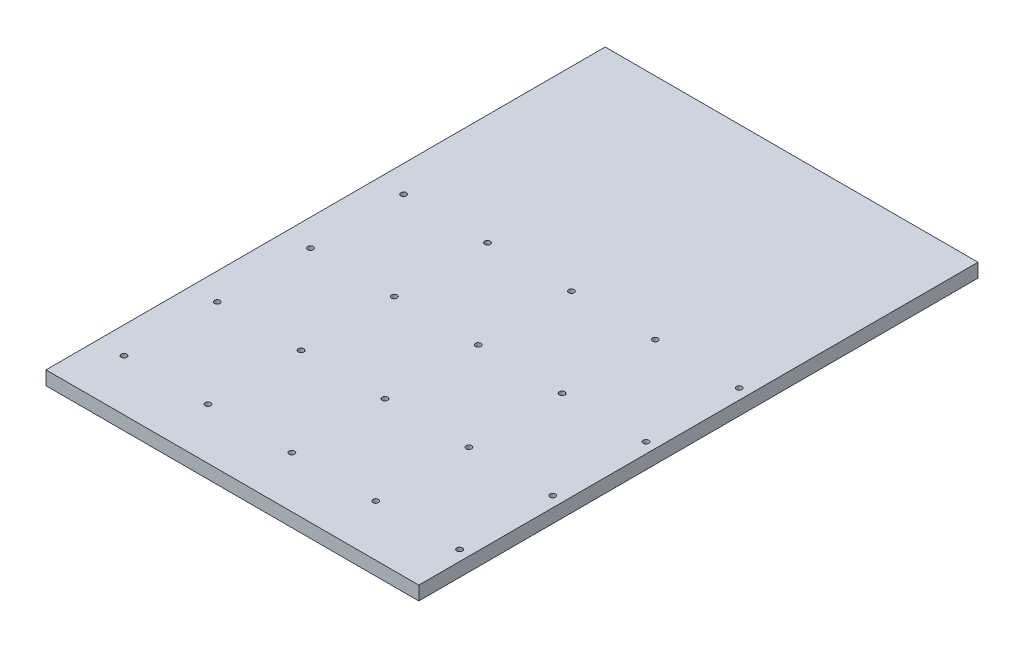
ISO-10303-21;
HEADER;
FILE_DESCRIPTION(('STEP AP214'),'2;1');
FILE_NAME('part.step','',(''),(''),'','','');
FILE_SCHEMA(('AUTOMOTIVE_DESIGN { 1 0 10303 214 1 1 1 1 }'));
ENDSEC;
DATA;
#1=APPLICATION_CONTEXT('core data for automotive mechanical design processes');
#2=APPLICATION_PROTOCOL_DEFINITION('international standard','automotive_design',2000,#1);
#3=PRODUCT_CONTEXT('',#1,'mechanical');
#4=PRODUCT('Part','Part','',(#3));
#5=PRODUCT_RELATED_PRODUCT_CATEGORY('part','',(#4));
#6=PRODUCT_DEFINITION_FORMATION('','',#4);
#7=PRODUCT_DEFINITION_CONTEXT('part definition',#1,'design');
#8=PRODUCT_DEFINITION('design','',#6,#7);
#9=PRODUCT_DEFINITION_SHAPE('','',#8);
#10=(LENGTH_UNIT() NAMED_UNIT(*) SI_UNIT(.MILLI.,.METRE.));
#11=(NAMED_UNIT(*) PLANE_ANGLE_UNIT() SI_UNIT($,.RADIAN.));
#12=(NAMED_UNIT(*) SI_UNIT($,.STERADIAN.) SOLID_ANGLE_UNIT());
#13=UNCERTAINTY_MEASURE_WITH_UNIT(LENGTH_MEASURE(1.E-05),#10,'distance_accuracy_value','');
#14=(GEOMETRIC_REPRESENTATION_CONTEXT(3) GLOBAL_UNCERTAINTY_ASSIGNED_CONTEXT((#13)) GLOBAL_UNIT_ASSIGNED_CONTEXT((#10,
#11,#12)) REPRESENTATION_CONTEXT('',''));
#15=CARTESIAN_POINT('',(0.,0.,0.));
#16=DIRECTION('',(0.,0.,1.));
#17=DIRECTION('',(1.,0.,0.));
#18=AXIS2_PLACEMENT_3D('',#15,#16,#17);
#19=CARTESIAN_POINT('',(0.,14.8,0.));
#20=DIRECTION('',(0.,-1.,0.));
#21=DIRECTION('',(0.,0.,-1.));
#22=AXIS2_PLACEMENT_3D('',#19,#20,#21);
#23=PLANE('',#22);
#24=DIRECTION('',(0.,0.,1.));
#25=VECTOR('',#24,1.);
#26=CARTESIAN_POINT('',(0.,14.8,0.));
#27=LINE('',#26,#25);
#28=CARTESIAN_POINT('',(0.,14.8,-600.));
#29=VERTEX_POINT('',#28);
#30=CARTESIAN_POINT('',(0.,14.8,0.));
#31=VERTEX_POINT('',#30);
#32=EDGE_CURVE('E98',#29,#31,#27,.T.);
#33=ORIENTED_EDGE('',*,*,#32,.T.);
#34=DIRECTION('',(1.,0.,0.));
#35=VECTOR('',#34,1.);
#36=CARTESIAN_POINT('',(0.,14.8,0.));
#37=LINE('',#36,#35);
#38=CARTESIAN_POINT('',(400.,14.8,0.));
#39=VERTEX_POINT('',#38);
#40=EDGE_CURVE('E93',#31,#39,#37,.T.);
#41=ORIENTED_EDGE('',*,*,#40,.T.);
#42=DIRECTION('',(0.,0.,-1.));
#43=VECTOR('',#42,1.);
#44=CARTESIAN_POINT('',(400.,14.8,0.));
#45=LINE('',#44,#43);
#46=CARTESIAN_POINT('',(400.,14.8,-600.));
#47=VERTEX_POINT('',#46);
#48=EDGE_CURVE('E96',#39,#47,#45,.T.);
#49=ORIENTED_EDGE('',*,*,#48,.T.);
#50=DIRECTION('',(-1.,0.,0.));
#51=VECTOR('',#50,1.);
#52=CARTESIAN_POINT('',(0.,14.8,-600.));
#53=LINE('',#52,#51);
#54=EDGE_CURVE('E63',#47,#29,#53,.T.);
#55=ORIENTED_EDGE('',*,*,#54,.T.);
#56=EDGE_LOOP('',(#33,#41,#49,#55));
#57=FACE_BOUND('',#56,.T.);
#58=CARTESIAN_POINT('',(28.7499999999969,14.8,-355.));
#59=DIRECTION('',(0.,1.,0.));
#60=DIRECTION('',(0.,0.,1.));
#61=AXIS2_PLACEMENT_3D('',#58,#59,#60);
#62=CIRCLE('',#61,2.99999999999996);
#63=CARTESIAN_POINT('',(28.7499999999969,14.8,-352.));
#64=VERTEX_POINT('',#63);
#65=EDGE_CURVE('E118',#64,#64,#62,.T.);
#66=ORIENTED_EDGE('',*,*,#65,.F.);
#67=EDGE_LOOP('',(#66));
#68=FACE_BOUND('',#67,.T.);
#69=CARTESIAN_POINT('',(118.749999999997,14.8,-355.));
#70=DIRECTION('',(0.,1.,0.));
#71=DIRECTION('',(0.,0.,1.));
#72=AXIS2_PLACEMENT_3D('',#69,#70,#71);
#73=CIRCLE('',#72,2.99999999999999);
#74=CARTESIAN_POINT('',(118.749999999997,14.8,-352.));
#75=VERTEX_POINT('',#74);
#76=EDGE_CURVE('E140',#75,#75,#73,.T.);
#77=ORIENTED_EDGE('',*,*,#76,.F.);
#78=EDGE_LOOP('',(#77));
#79=FACE_BOUND('',#78,.T.);
#80=CARTESIAN_POINT('',(208.749999999997,14.8,-355.));
#81=DIRECTION('',(0.,1.,0.));
#82=DIRECTION('',(0.,0.,1.));
#83=AXIS2_PLACEMENT_3D('',#80,#81,#82);
#84=CIRCLE('',#83,3.00000000000017);
#85=CARTESIAN_POINT('',(208.749999999997,14.8,-352.));
#86=VERTEX_POINT('',#85);
#87=EDGE_CURVE('E148',#86,#86,#84,.T.);
#88=ORIENTED_EDGE('',*,*,#87,.F.);
#89=EDGE_LOOP('',(#88));
#90=FACE_BOUND('',#89,.T.);
#91=CARTESIAN_POINT('',(298.749999999997,14.8,-355.));
#92=DIRECTION('',(0.,1.,0.));
#93=DIRECTION('',(0.,0.,1.));
#94=AXIS2_PLACEMENT_3D('',#91,#92,#93);
#95=CIRCLE('',#94,3.00000000000005);
#96=CARTESIAN_POINT('',(298.749999999997,14.8,-352.));
#97=VERTEX_POINT('',#96);
#98=EDGE_CURVE('E156',#97,#97,#95,.T.);
#99=ORIENTED_EDGE('',*,*,#98,.F.);
#100=EDGE_LOOP('',(#99));
#101=FACE_BOUND('',#100,.T.);
#102=CARTESIAN_POINT('',(388.749999999997,14.8,-355.));
#103=DIRECTION('',(0.,1.,0.));
#104=DIRECTION('',(0.,0.,1.));
#105=AXIS2_PLACEMENT_3D('',#102,#103,#104);
#106=CIRCLE('',#105,3.00000000000005);
#107=CARTESIAN_POINT('',(388.749999999997,14.8,-352.));
#108=VERTEX_POINT('',#107);
#109=EDGE_CURVE('E164',#108,#108,#106,.T.);
#110=ORIENTED_EDGE('',*,*,#109,.F.);
#111=EDGE_LOOP('',(#110));
#112=FACE_BOUND('',#111,.T.);
#113=CARTESIAN_POINT('',(28.7499999999979,14.8,-255.));
#114=DIRECTION('',(0.,1.,0.));
#115=DIRECTION('',(0.,0.,1.));
#116=AXIS2_PLACEMENT_3D('',#113,#114,#115);
#117=CIRCLE('',#116,2.99999999999996);
#118=CARTESIAN_POINT('',(28.7499999999979,14.8,-252.));
#119=VERTEX_POINT('',#118);
#120=EDGE_CURVE('E172',#119,#119,#117,.T.);
#121=ORIENTED_EDGE('',*,*,#120,.F.);
#122=EDGE_LOOP('',(#121));
#123=FACE_BOUND('',#122,.T.);
#124=CARTESIAN_POINT('',(118.749999999998,14.8,-255.));
#125=DIRECTION('',(0.,1.,0.));
#126=DIRECTION('',(0.,0.,1.));
#127=AXIS2_PLACEMENT_3D('',#124,#125,#126);
#128=CIRCLE('',#127,2.99999999999998);
#129=CARTESIAN_POINT('',(118.749999999998,14.8,-252.));
#130=VERTEX_POINT('',#129);
#131=EDGE_CURVE('E180',#130,#130,#128,.T.);
#132=ORIENTED_EDGE('',*,*,#131,.F.);
#133=EDGE_LOOP('',(#132));
#134=FACE_BOUND('',#133,.T.);
#135=CARTESIAN_POINT('',(208.749999999998,14.8,-255.));
#136=DIRECTION('',(0.,1.,0.));
#137=DIRECTION('',(0.,0.,1.));
#138=AXIS2_PLACEMENT_3D('',#135,#136,#137);
#139=CIRCLE('',#138,3.00000000000014);
#140=CARTESIAN_POINT('',(208.749999999998,14.8,-252.));
#141=VERTEX_POINT('',#140);
#142=EDGE_CURVE('E188',#141,#141,#139,.T.);
#143=ORIENTED_EDGE('',*,*,#142,.F.);
#144=EDGE_LOOP('',(#143));
#145=FACE_BOUND('',#144,.T.);
#146=CARTESIAN_POINT('',(298.749999999998,14.8,-255.));
#147=DIRECTION('',(0.,1.,0.));
#148=DIRECTION('',(0.,0.,1.));
#149=AXIS2_PLACEMENT_3D('',#146,#147,#148);
#150=CIRCLE('',#149,3.00000000000005);
#151=CARTESIAN_POINT('',(298.749999999998,14.8,-252.));
#152=VERTEX_POINT('',#151);
#153=EDGE_CURVE('E196',#152,#152,#150,.T.);
#154=ORIENTED_EDGE('',*,*,#153,.F.);
#155=EDGE_LOOP('',(#154));
#156=FACE_BOUND('',#155,.T.);
#157=CARTESIAN_POINT('',(388.749999999998,14.8,-255.));
#158=DIRECTION('',(0.,1.,0.));
#159=DIRECTION('',(0.,0.,1.));
#160=AXIS2_PLACEMENT_3D('',#157,#158,#159);
#161=CIRCLE('',#160,3.00000000000005);
#162=CARTESIAN_POINT('',(388.749999999998,14.8,-252.));
#163=VERTEX_POINT('',#162);
#164=EDGE_CURVE('E204',#163,#163,#161,.T.);
#165=ORIENTED_EDGE('',*,*,#164,.F.);
#166=EDGE_LOOP('',(#165));
#167=FACE_BOUND('',#166,.T.);
#168=CARTESIAN_POINT('',(28.749999999999,14.8,-155.));
#169=DIRECTION('',(0.,1.,0.));
#170=DIRECTION('',(0.,0.,1.));
#171=AXIS2_PLACEMENT_3D('',#168,#169,#170);
#172=CIRCLE('',#171,2.99999999999993);
#173=CARTESIAN_POINT('',(28.749999999999,14.8,-152.));
#174=VERTEX_POINT('',#173);
#175=EDGE_CURVE('E212',#174,#174,#172,.T.);
#176=ORIENTED_EDGE('',*,*,#175,.F.);
#177=EDGE_LOOP('',(#176));
#178=FACE_BOUND('',#177,.T.);
#179=CARTESIAN_POINT('',(118.749999999999,14.8,-155.));
#180=DIRECTION('',(0.,1.,0.));
#181=DIRECTION('',(0.,0.,1.));
#182=AXIS2_PLACEMENT_3D('',#179,#180,#181);
#183=CIRCLE('',#182,2.99999999999995);
#184=CARTESIAN_POINT('',(118.749999999999,14.8,-152.));
#185=VERTEX_POINT('',#184);
#186=EDGE_CURVE('E220',#185,#185,#183,.T.);
#187=ORIENTED_EDGE('',*,*,#186,.F.);
#188=EDGE_LOOP('',(#187));
#189=FACE_BOUND('',#188,.T.);
#190=CARTESIAN_POINT('',(208.749999999999,14.8,-155.));
#191=DIRECTION('',(0.,1.,0.));
#192=DIRECTION('',(0.,0.,1.));
#193=AXIS2_PLACEMENT_3D('',#190,#191,#192);
#194=CIRCLE('',#193,3.00000000000017);
#195=CARTESIAN_POINT('',(208.749999999999,14.8,-152.));
#196=VERTEX_POINT('',#195);
#197=EDGE_CURVE('E228',#196,#196,#194,.T.);
#198=ORIENTED_EDGE('',*,*,#197,.F.);
#199=EDGE_LOOP('',(#198));
#200=FACE_BOUND('',#199,.T.);
#201=CARTESIAN_POINT('',(298.749999999999,14.8,-155.));
#202=DIRECTION('',(0.,1.,0.));
#203=DIRECTION('',(0.,0.,1.));
#204=AXIS2_PLACEMENT_3D('',#201,#202,#203);
#205=CIRCLE('',#204,3.00000000000006);
#206=CARTESIAN_POINT('',(298.749999999999,14.8,-152.));
#207=VERTEX_POINT('',#206);
#208=EDGE_CURVE('E236',#207,#207,#205,.T.);
#209=ORIENTED_EDGE('',*,*,#208,.F.);
#210=EDGE_LOOP('',(#209));
#211=FACE_BOUND('',#210,.T.);
#212=CARTESIAN_POINT('',(388.749999999999,14.8,-155.));
#213=DIRECTION('',(0.,1.,0.));
#214=DIRECTION('',(0.,0.,1.));
#215=AXIS2_PLACEMENT_3D('',#212,#213,#214);
#216=CIRCLE('',#215,3.00000000000006);
#217=CARTESIAN_POINT('',(388.749999999999,14.8,-152.));
#218=VERTEX_POINT('',#217);
#219=EDGE_CURVE('E244',#218,#218,#216,.T.);
#220=ORIENTED_EDGE('',*,*,#219,.F.);
#221=EDGE_LOOP('',(#220));
#222=FACE_BOUND('',#221,.T.);
#223=CARTESIAN_POINT('',(28.75,14.8,-55.));
#224=DIRECTION('',(0.,1.,0.));
#225=DIRECTION('',(0.,0.,1.));
#226=AXIS2_PLACEMENT_3D('',#223,#224,#225);
#227=CIRCLE('',#226,2.99999999999994);
#228=CARTESIAN_POINT('',(28.75,14.8,-52.0000000000001));
#229=VERTEX_POINT('',#228);
#230=EDGE_CURVE('E252',#229,#229,#227,.T.);
#231=ORIENTED_EDGE('',*,*,#230,.F.);
#232=EDGE_LOOP('',(#231));
#233=FACE_BOUND('',#232,.T.);
#234=CARTESIAN_POINT('',(118.75,14.8,-55.));
#235=DIRECTION('',(0.,1.,0.));
#236=DIRECTION('',(0.,0.,1.));
#237=AXIS2_PLACEMENT_3D('',#234,#235,#236);
#238=CIRCLE('',#237,2.99999999999995);
#239=CARTESIAN_POINT('',(118.75,14.8,-52.));
#240=VERTEX_POINT('',#239);
#241=EDGE_CURVE('E260',#240,#240,#238,.T.);
#242=ORIENTED_EDGE('',*,*,#241,.F.);
#243=EDGE_LOOP('',(#242));
#244=FACE_BOUND('',#243,.T.);
#245=CARTESIAN_POINT('',(208.75,14.8,-55.));
#246=DIRECTION('',(0.,1.,0.));
#247=DIRECTION('',(0.,0.,1.));
#248=AXIS2_PLACEMENT_3D('',#245,#246,#247);
#249=CIRCLE('',#248,3.00000000000017);
#250=CARTESIAN_POINT('',(208.75,14.8,-51.9999999999998));
#251=VERTEX_POINT('',#250);
#252=EDGE_CURVE('E268',#251,#251,#249,.T.);
#253=ORIENTED_EDGE('',*,*,#252,.F.);
#254=EDGE_LOOP('',(#253));
#255=FACE_BOUND('',#254,.T.);
#256=CARTESIAN_POINT('',(298.75,14.8,-55.));
#257=DIRECTION('',(0.,1.,0.));
#258=DIRECTION('',(0.,0.,1.));
#259=AXIS2_PLACEMENT_3D('',#256,#257,#258);
#260=CIRCLE('',#259,3.00000000000005);
#261=CARTESIAN_POINT('',(298.75,14.8,-52.));
#262=VERTEX_POINT('',#261);
#263=EDGE_CURVE('E276',#262,#262,#260,.T.);
#264=ORIENTED_EDGE('',*,*,#263,.F.);
#265=EDGE_LOOP('',(#264));
#266=FACE_BOUND('',#265,.T.);
#267=CARTESIAN_POINT('',(388.75,14.8,-55.));
#268=DIRECTION('',(0.,1.,0.));
#269=DIRECTION('',(0.,0.,1.));
#270=AXIS2_PLACEMENT_3D('',#267,#268,#269);
#271=CIRCLE('',#270,3.00000000000005);
#272=CARTESIAN_POINT('',(388.75,14.8,-51.9999999999999));
#273=VERTEX_POINT('',#272);
#274=EDGE_CURVE('E284',#273,#273,#271,.T.);
#275=ORIENTED_EDGE('',*,*,#274,.F.);
#276=EDGE_LOOP('',(#275));
#277=FACE_BOUND('',#276,.T.);
#278=ADVANCED_FACE('F45',(#57,#68,#79,#90,#101,#112,#123,#134,#145,#156,#167,#178,#189,#200,
#211,#222,#233,#244,#255,#266,#277),#23,.F.);
#279=CARTESIAN_POINT('',(0.,0.,0.));
#280=DIRECTION('',(0.,-1.,0.));
#281=DIRECTION('',(0.,0.,-1.));
#282=AXIS2_PLACEMENT_3D('',#279,#280,#281);
#283=PLANE('',#282);
#284=CARTESIAN_POINT('',(298.75,0.,-55.));
#285=DIRECTION('',(0.,1.,0.));
#286=DIRECTION('',(0.,0.,1.));
#287=AXIS2_PLACEMENT_3D('',#284,#285,#286);
#288=CIRCLE('',#287,3.00000000000005);
#289=CARTESIAN_POINT('',(298.75,0.,-52.));
#290=VERTEX_POINT('',#289);
#291=EDGE_CURVE('E280',#290,#290,#288,.T.);
#292=ORIENTED_EDGE('',*,*,#291,.T.);
#293=EDGE_LOOP('',(#292));
#294=FACE_BOUND('',#293,.T.);
#295=CARTESIAN_POINT('',(118.75,0.,-55.));
#296=DIRECTION('',(0.,1.,0.));
#297=DIRECTION('',(0.,0.,1.));
#298=AXIS2_PLACEMENT_3D('',#295,#296,#297);
#299=CIRCLE('',#298,2.99999999999995);
#300=CARTESIAN_POINT('',(118.75,0.,-52.));
#301=VERTEX_POINT('',#300);
#302=EDGE_CURVE('E264',#301,#301,#299,.T.);
#303=ORIENTED_EDGE('',*,*,#302,.T.);
#304=EDGE_LOOP('',(#303));
#305=FACE_BOUND('',#304,.T.);
#306=CARTESIAN_POINT('',(388.749999999999,0.,-155.));
#307=DIRECTION('',(0.,1.,0.));
#308=DIRECTION('',(0.,0.,1.));
#309=AXIS2_PLACEMENT_3D('',#306,#307,#308);
#310=CIRCLE('',#309,3.00000000000006);
#311=CARTESIAN_POINT('',(388.749999999999,0.,-152.));
#312=VERTEX_POINT('',#311);
#313=EDGE_CURVE('E248',#312,#312,#310,.T.);
#314=ORIENTED_EDGE('',*,*,#313,.T.);
#315=EDGE_LOOP('',(#314));
#316=FACE_BOUND('',#315,.T.);
#317=CARTESIAN_POINT('',(208.749999999999,0.,-155.));
#318=DIRECTION('',(0.,1.,0.));
#319=DIRECTION('',(0.,0.,1.));
#320=AXIS2_PLACEMENT_3D('',#317,#318,#319);
#321=CIRCLE('',#320,3.00000000000017);
#322=CARTESIAN_POINT('',(208.749999999999,0.,-152.));
#323=VERTEX_POINT('',#322);
#324=EDGE_CURVE('E232',#323,#323,#321,.T.);
#325=ORIENTED_EDGE('',*,*,#324,.T.);
#326=EDGE_LOOP('',(#325));
#327=FACE_BOUND('',#326,.T.);
#328=CARTESIAN_POINT('',(28.749999999999,0.,-155.));
#329=DIRECTION('',(0.,1.,0.));
#330=DIRECTION('',(0.,0.,1.));
#331=AXIS2_PLACEMENT_3D('',#328,#329,#330);
#332=CIRCLE('',#331,2.99999999999993);
#333=CARTESIAN_POINT('',(28.749999999999,0.,-152.));
#334=VERTEX_POINT('',#333);
#335=EDGE_CURVE('E216',#334,#334,#332,.T.);
#336=ORIENTED_EDGE('',*,*,#335,.T.);
#337=EDGE_LOOP('',(#336));
#338=FACE_BOUND('',#337,.T.);
#339=CARTESIAN_POINT('',(298.749999999998,0.,-255.));
#340=DIRECTION('',(0.,1.,0.));
#341=DIRECTION('',(0.,0.,1.));
#342=AXIS2_PLACEMENT_3D('',#339,#340,#341);
#343=CIRCLE('',#342,3.00000000000005);
#344=CARTESIAN_POINT('',(298.749999999998,0.,-252.));
#345=VERTEX_POINT('',#344);
#346=EDGE_CURVE('E200',#345,#345,#343,.T.);
#347=ORIENTED_EDGE('',*,*,#346,.T.);
#348=EDGE_LOOP('',(#347));
#349=FACE_BOUND('',#348,.T.);
#350=CARTESIAN_POINT('',(118.749999999998,0.,-255.));
#351=DIRECTION('',(0.,1.,0.));
#352=DIRECTION('',(0.,0.,1.));
#353=AXIS2_PLACEMENT_3D('',#350,#351,#352);
#354=CIRCLE('',#353,2.99999999999998);
#355=CARTESIAN_POINT('',(118.749999999998,0.,-252.));
#356=VERTEX_POINT('',#355);
#357=EDGE_CURVE('E184',#356,#356,#354,.T.);
#358=ORIENTED_EDGE('',*,*,#357,.T.);
#359=EDGE_LOOP('',(#358));
#360=FACE_BOUND('',#359,.T.);
#361=CARTESIAN_POINT('',(388.749999999997,0.,-355.));
#362=DIRECTION('',(0.,1.,0.));
#363=DIRECTION('',(0.,0.,1.));
#364=AXIS2_PLACEMENT_3D('',#361,#362,#363);
#365=CIRCLE('',#364,3.00000000000005);
#366=CARTESIAN_POINT('',(388.749999999997,0.,-352.));
#367=VERTEX_POINT('',#366);
#368=EDGE_CURVE('E168',#367,#367,#365,.T.);
#369=ORIENTED_EDGE('',*,*,#368,.T.);
#370=EDGE_LOOP('',(#369));
#371=FACE_BOUND('',#370,.T.);
#372=CARTESIAN_POINT('',(208.749999999997,0.,-355.));
#373=DIRECTION('',(0.,1.,0.));
#374=DIRECTION('',(0.,0.,1.));
#375=AXIS2_PLACEMENT_3D('',#372,#373,#374);
#376=CIRCLE('',#375,3.00000000000017);
#377=CARTESIAN_POINT('',(208.749999999997,0.,-352.));
#378=VERTEX_POINT('',#377);
#379=EDGE_CURVE('E152',#378,#378,#376,.T.);
#380=ORIENTED_EDGE('',*,*,#379,.T.);
#381=EDGE_LOOP('',(#380));
#382=FACE_BOUND('',#381,.T.);
#383=CARTESIAN_POINT('',(28.7499999999969,0.,-355.));
#384=DIRECTION('',(0.,1.,0.));
#385=DIRECTION('',(0.,0.,1.));
#386=AXIS2_PLACEMENT_3D('',#383,#384,#385);
#387=CIRCLE('',#386,2.99999999999996);
#388=CARTESIAN_POINT('',(28.7499999999969,0.,-352.));
#389=VERTEX_POINT('',#388);
#390=EDGE_CURVE('E136',#389,#389,#387,.T.);
#391=ORIENTED_EDGE('',*,*,#390,.T.);
#392=EDGE_LOOP('',(#391));
#393=FACE_BOUND('',#392,.T.);
#394=DIRECTION('',(0.,0.,1.));
#395=VECTOR('',#394,1.);
#396=CARTESIAN_POINT('',(0.,0.,0.));
#397=LINE('',#396,#395);
#398=CARTESIAN_POINT('',(0.,0.,-600.));
#399=VERTEX_POINT('',#398);
#400=CARTESIAN_POINT('',(0.,0.,0.));
#401=VERTEX_POINT('',#400);
#402=EDGE_CURVE('E114',#399,#401,#397,.T.);
#403=ORIENTED_EDGE('',*,*,#402,.F.);
#404=DIRECTION('',(-1.,0.,0.));
#405=VECTOR('',#404,1.);
#406=CARTESIAN_POINT('',(0.,0.,-600.));
#407=LINE('',#406,#405);
#408=CARTESIAN_POINT('',(400.,0.,-600.));
#409=VERTEX_POINT('',#408);
#410=EDGE_CURVE('E86',#409,#399,#407,.T.);
#411=ORIENTED_EDGE('',*,*,#410,.F.);
#412=DIRECTION('',(0.,0.,-1.));
#413=VECTOR('',#412,1.);
#414=CARTESIAN_POINT('',(400.,0.,0.));
#415=LINE('',#414,#413);
#416=CARTESIAN_POINT('',(400.,0.,0.));
#417=VERTEX_POINT('',#416);
#418=EDGE_CURVE('E80',#417,#409,#415,.T.);
#419=ORIENTED_EDGE('',*,*,#418,.F.);
#420=DIRECTION('',(1.,0.,0.));
#421=VECTOR('',#420,1.);
#422=CARTESIAN_POINT('',(0.,0.,0.));
#423=LINE('',#422,#421);
#424=EDGE_CURVE('E103',#401,#417,#423,.T.);
#425=ORIENTED_EDGE('',*,*,#424,.F.);
#426=EDGE_LOOP('',(#403,#411,#419,#425));
#427=FACE_BOUND('',#426,.T.);
#428=CARTESIAN_POINT('',(118.749999999997,0.,-355.));
#429=DIRECTION('',(0.,1.,0.));
#430=DIRECTION('',(0.,0.,1.));
#431=AXIS2_PLACEMENT_3D('',#428,#429,#430);
#432=CIRCLE('',#431,2.99999999999999);
#433=CARTESIAN_POINT('',(118.749999999997,0.,-352.));
#434=VERTEX_POINT('',#433);
#435=EDGE_CURVE('E144',#434,#434,#432,.T.);
#436=ORIENTED_EDGE('',*,*,#435,.T.);
#437=EDGE_LOOP('',(#436));
#438=FACE_BOUND('',#437,.T.);
#439=CARTESIAN_POINT('',(298.749999999997,0.,-355.));
#440=DIRECTION('',(0.,1.,0.));
#441=DIRECTION('',(0.,0.,1.));
#442=AXIS2_PLACEMENT_3D('',#439,#440,#441);
#443=CIRCLE('',#442,3.00000000000005);
#444=CARTESIAN_POINT('',(298.749999999997,0.,-352.));
#445=VERTEX_POINT('',#444);
#446=EDGE_CURVE('E160',#445,#445,#443,.T.);
#447=ORIENTED_EDGE('',*,*,#446,.T.);
#448=EDGE_LOOP('',(#447));
#449=FACE_BOUND('',#448,.T.);
#450=CARTESIAN_POINT('',(28.7499999999979,0.,-255.));
#451=DIRECTION('',(0.,1.,0.));
#452=DIRECTION('',(0.,0.,1.));
#453=AXIS2_PLACEMENT_3D('',#450,#451,#452);
#454=CIRCLE('',#453,2.99999999999996);
#455=CARTESIAN_POINT('',(28.7499999999979,0.,-252.));
#456=VERTEX_POINT('',#455);
#457=EDGE_CURVE('E176',#456,#456,#454,.T.);
#458=ORIENTED_EDGE('',*,*,#457,.T.);
#459=EDGE_LOOP('',(#458));
#460=FACE_BOUND('',#459,.T.);
#461=CARTESIAN_POINT('',(208.749999999998,0.,-255.));
#462=DIRECTION('',(0.,1.,0.));
#463=DIRECTION('',(0.,0.,1.));
#464=AXIS2_PLACEMENT_3D('',#461,#462,#463);
#465=CIRCLE('',#464,3.00000000000014);
#466=CARTESIAN_POINT('',(208.749999999998,0.,-252.));
#467=VERTEX_POINT('',#466);
#468=EDGE_CURVE('E192',#467,#467,#465,.T.);
#469=ORIENTED_EDGE('',*,*,#468,.T.);
#470=EDGE_LOOP('',(#469));
#471=FACE_BOUND('',#470,.T.);
#472=CARTESIAN_POINT('',(388.749999999998,0.,-255.));
#473=DIRECTION('',(0.,1.,0.));
#474=DIRECTION('',(0.,0.,1.));
#475=AXIS2_PLACEMENT_3D('',#472,#473,#474);
#476=CIRCLE('',#475,3.00000000000005);
#477=CARTESIAN_POINT('',(388.749999999998,0.,-252.));
#478=VERTEX_POINT('',#477);
#479=EDGE_CURVE('E208',#478,#478,#476,.T.);
#480=ORIENTED_EDGE('',*,*,#479,.T.);
#481=EDGE_LOOP('',(#480));
#482=FACE_BOUND('',#481,.T.);
#483=CARTESIAN_POINT('',(118.749999999999,0.,-155.));
#484=DIRECTION('',(0.,1.,0.));
#485=DIRECTION('',(0.,0.,1.));
#486=AXIS2_PLACEMENT_3D('',#483,#484,#485);
#487=CIRCLE('',#486,2.99999999999995);
#488=CARTESIAN_POINT('',(118.749999999999,0.,-152.));
#489=VERTEX_POINT('',#488);
#490=EDGE_CURVE('E224',#489,#489,#487,.T.);
#491=ORIENTED_EDGE('',*,*,#490,.T.);
#492=EDGE_LOOP('',(#491));
#493=FACE_BOUND('',#492,.T.);
#494=CARTESIAN_POINT('',(298.749999999999,0.,-155.));
#495=DIRECTION('',(0.,1.,0.));
#496=DIRECTION('',(0.,0.,1.));
#497=AXIS2_PLACEMENT_3D('',#494,#495,#496);
#498=CIRCLE('',#497,3.00000000000006);
#499=CARTESIAN_POINT('',(298.749999999999,0.,-152.));
#500=VERTEX_POINT('',#499);
#501=EDGE_CURVE('E240',#500,#500,#498,.T.);
#502=ORIENTED_EDGE('',*,*,#501,.T.);
#503=EDGE_LOOP('',(#502));
#504=FACE_BOUND('',#503,.T.);
#505=CARTESIAN_POINT('',(28.75,0.,-55.));
#506=DIRECTION('',(0.,1.,0.));
#507=DIRECTION('',(0.,0.,1.));
#508=AXIS2_PLACEMENT_3D('',#505,#506,#507);
#509=CIRCLE('',#508,2.99999999999994);
#510=CARTESIAN_POINT('',(28.75,0.,-52.0000000000001));
#511=VERTEX_POINT('',#510);
#512=EDGE_CURVE('E256',#511,#511,#509,.T.);
#513=ORIENTED_EDGE('',*,*,#512,.T.);
#514=EDGE_LOOP('',(#513));
#515=FACE_BOUND('',#514,.T.);
#516=CARTESIAN_POINT('',(208.75,0.,-55.));
#517=DIRECTION('',(0.,1.,0.));
#518=DIRECTION('',(0.,0.,1.));
#519=AXIS2_PLACEMENT_3D('',#516,#517,#518);
#520=CIRCLE('',#519,3.00000000000017);
#521=CARTESIAN_POINT('',(208.75,0.,-51.9999999999998));
#522=VERTEX_POINT('',#521);
#523=EDGE_CURVE('E272',#522,#522,#520,.T.);
#524=ORIENTED_EDGE('',*,*,#523,.T.);
#525=EDGE_LOOP('',(#524));
#526=FACE_BOUND('',#525,.T.);
#527=CARTESIAN_POINT('',(388.75,0.,-55.));
#528=DIRECTION('',(0.,1.,0.));
#529=DIRECTION('',(0.,0.,1.));
#530=AXIS2_PLACEMENT_3D('',#527,#528,#529);
#531=CIRCLE('',#530,3.00000000000005);
#532=CARTESIAN_POINT('',(388.75,0.,-51.9999999999999));
#533=VERTEX_POINT('',#532);
#534=EDGE_CURVE('E288',#533,#533,#531,.T.);
#535=ORIENTED_EDGE('',*,*,#534,.T.);
#536=EDGE_LOOP('',(#535));
#537=FACE_BOUND('',#536,.T.);
#538=ADVANCED_FACE('F131',(#294,#305,#316,#327,#338,#349,#360,#371,#382,#393,#427,#438,#449,
#460,#471,#482,#493,#504,#515,#526,#537),#283,.T.);
#539=CARTESIAN_POINT('',(0.,14.8,0.));
#540=DIRECTION('',(1.,0.,0.));
#541=DIRECTION('',(0.,0.,-1.));
#542=AXIS2_PLACEMENT_3D('',#539,#540,#541);
#543=PLANE('',#542);
#544=ORIENTED_EDGE('',*,*,#402,.T.);
#545=DIRECTION('',(0.,-1.,0.));
#546=VECTOR('',#545,1.);
#547=CARTESIAN_POINT('',(0.,14.8,0.));
#548=LINE('',#547,#546);
#549=EDGE_CURVE('E11',#31,#401,#548,.T.);
#550=ORIENTED_EDGE('',*,*,#549,.F.);
#551=ORIENTED_EDGE('',*,*,#32,.F.);
#552=DIRECTION('',(0.,-1.,0.));
#553=VECTOR('',#552,1.);
#554=CARTESIAN_POINT('',(0.,14.8,-600.));
#555=LINE('',#554,#553);
#556=EDGE_CURVE('E110',#29,#399,#555,.T.);
#557=ORIENTED_EDGE('',*,*,#556,.T.);
#558=EDGE_LOOP('',(#544,#550,#551,#557));
#559=FACE_BOUND('',#558,.T.);
#560=ADVANCED_FACE('F47',(#559),#543,.F.);
#561=CARTESIAN_POINT('',(0.,14.8,0.));
#562=DIRECTION('',(0.,0.,-1.));
#563=DIRECTION('',(-1.,0.,0.));
#564=AXIS2_PLACEMENT_3D('',#561,#562,#563);
#565=PLANE('',#564);
#566=ORIENTED_EDGE('',*,*,#424,.T.);
#567=DIRECTION('',(0.,-1.,0.));
#568=VECTOR('',#567,1.);
#569=CARTESIAN_POINT('',(400.,14.8,0.));
#570=LINE('',#569,#568);
#571=EDGE_CURVE('E55',#39,#417,#570,.T.);
#572=ORIENTED_EDGE('',*,*,#571,.F.);
#573=ORIENTED_EDGE('',*,*,#40,.F.);
#574=ORIENTED_EDGE('',*,*,#549,.T.);
#575=EDGE_LOOP('',(#566,#572,#573,#574));
#576=FACE_BOUND('',#575,.T.);
#577=ADVANCED_FACE('F102',(#576),#565,.F.);
#578=CARTESIAN_POINT('',(400.,14.8,0.));
#579=DIRECTION('',(-1.,0.,0.));
#580=DIRECTION('',(0.,0.,1.));
#581=AXIS2_PLACEMENT_3D('',#578,#579,#580);
#582=PLANE('',#581);
#583=ORIENTED_EDGE('',*,*,#418,.T.);
#584=DIRECTION('',(0.,-1.,0.));
#585=VECTOR('',#584,1.);
#586=CARTESIAN_POINT('',(400.,14.8,-600.));
#587=LINE('',#586,#585);
#588=EDGE_CURVE('E105',#47,#409,#587,.T.);
#589=ORIENTED_EDGE('',*,*,#588,.F.);
#590=ORIENTED_EDGE('',*,*,#48,.F.);
#591=ORIENTED_EDGE('',*,*,#571,.T.);
#592=EDGE_LOOP('',(#583,#589,#590,#591));
#593=FACE_BOUND('',#592,.T.);
#594=ADVANCED_FACE('F106',(#593),#582,.F.);
#595=CARTESIAN_POINT('',(0.,14.8,-600.));
#596=DIRECTION('',(0.,0.,1.));
#597=DIRECTION('',(1.,0.,0.));
#598=AXIS2_PLACEMENT_3D('',#595,#596,#597);
#599=PLANE('',#598);
#600=ORIENTED_EDGE('',*,*,#410,.T.);
#601=ORIENTED_EDGE('',*,*,#556,.F.);
#602=ORIENTED_EDGE('',*,*,#54,.F.);
#603=ORIENTED_EDGE('',*,*,#588,.T.);
#604=EDGE_LOOP('',(#600,#601,#602,#603));
#605=FACE_BOUND('',#604,.T.);
#606=ADVANCED_FACE('F128',(#605),#599,.F.);
#607=CARTESIAN_POINT('',(28.7499999999969,14.8,-355.));
#608=DIRECTION('',(0.,-1.,0.));
#609=DIRECTION('',(0.,0.,-1.));
#610=AXIS2_PLACEMENT_3D('',#607,#608,#609);
#611=CYLINDRICAL_SURFACE('',#610,2.99999999999996);
#612=ORIENTED_EDGE('',*,*,#65,.T.);
#613=EDGE_LOOP('',(#612));
#614=FACE_BOUND('',#613,.T.);
#615=ORIENTED_EDGE('',*,*,#390,.F.);
#616=EDGE_LOOP('',(#615));
#617=FACE_BOUND('',#616,.T.);
#618=ADVANCED_FACE('F307',(#614,#617),#611,.F.);
#619=CARTESIAN_POINT('',(118.749999999997,14.8,-355.));
#620=DIRECTION('',(0.,-1.,0.));
#621=DIRECTION('',(0.,0.,-1.));
#622=AXIS2_PLACEMENT_3D('',#619,#620,#621);
#623=CYLINDRICAL_SURFACE('',#622,2.99999999999999);
#624=ORIENTED_EDGE('',*,*,#76,.T.);
#625=EDGE_LOOP('',(#624));
#626=FACE_BOUND('',#625,.T.);
#627=ORIENTED_EDGE('',*,*,#435,.F.);
#628=EDGE_LOOP('',(#627));
#629=FACE_BOUND('',#628,.T.);
#630=ADVANCED_FACE('F361',(#626,#629),#623,.F.);
#631=CARTESIAN_POINT('',(208.749999999997,14.8,-355.));
#632=DIRECTION('',(0.,-1.,0.));
#633=DIRECTION('',(0.,0.,-1.));
#634=AXIS2_PLACEMENT_3D('',#631,#632,#633);
#635=CYLINDRICAL_SURFACE('',#634,3.00000000000017);
#636=ORIENTED_EDGE('',*,*,#87,.T.);
#637=EDGE_LOOP('',(#636));
#638=FACE_BOUND('',#637,.T.);
#639=ORIENTED_EDGE('',*,*,#379,.F.);
#640=EDGE_LOOP('',(#639));
#641=FACE_BOUND('',#640,.T.);
#642=ADVANCED_FACE('F370',(#638,#641),#635,.F.);
#643=CARTESIAN_POINT('',(298.749999999997,14.8,-355.));
#644=DIRECTION('',(0.,-1.,0.));
#645=DIRECTION('',(0.,0.,-1.));
#646=AXIS2_PLACEMENT_3D('',#643,#644,#645);
#647=CYLINDRICAL_SURFACE('',#646,3.00000000000005);
#648=ORIENTED_EDGE('',*,*,#98,.T.);
#649=EDGE_LOOP('',(#648));
#650=FACE_BOUND('',#649,.T.);
#651=ORIENTED_EDGE('',*,*,#446,.F.);
#652=EDGE_LOOP('',(#651));
#653=FACE_BOUND('',#652,.T.);
#654=ADVANCED_FACE('F379',(#650,#653),#647,.F.);
#655=CARTESIAN_POINT('',(388.749999999997,14.8,-355.));
#656=DIRECTION('',(0.,-1.,0.));
#657=DIRECTION('',(0.,0.,-1.));
#658=AXIS2_PLACEMENT_3D('',#655,#656,#657);
#659=CYLINDRICAL_SURFACE('',#658,3.00000000000005);
#660=ORIENTED_EDGE('',*,*,#109,.T.);
#661=EDGE_LOOP('',(#660));
#662=FACE_BOUND('',#661,.T.);
#663=ORIENTED_EDGE('',*,*,#368,.F.);
#664=EDGE_LOOP('',(#663));
#665=FACE_BOUND('',#664,.T.);
#666=ADVANCED_FACE('F389',(#662,#665),#659,.F.);
#667=CARTESIAN_POINT('',(28.7499999999979,14.8,-255.));
#668=DIRECTION('',(0.,-1.,0.));
#669=DIRECTION('',(0.,0.,-1.));
#670=AXIS2_PLACEMENT_3D('',#667,#668,#669);
#671=CYLINDRICAL_SURFACE('',#670,2.99999999999996);
#672=ORIENTED_EDGE('',*,*,#120,.T.);
#673=EDGE_LOOP('',(#672));
#674=FACE_BOUND('',#673,.T.);
#675=ORIENTED_EDGE('',*,*,#457,.F.);
#676=EDGE_LOOP('',(#675));
#677=FACE_BOUND('',#676,.T.);
#678=ADVANCED_FACE('F399',(#674,#677),#671,.F.);
#679=CARTESIAN_POINT('',(118.749999999998,14.8,-255.));
#680=DIRECTION('',(0.,-1.,0.));
#681=DIRECTION('',(0.,0.,-1.));
#682=AXIS2_PLACEMENT_3D('',#679,#680,#681);
#683=CYLINDRICAL_SURFACE('',#682,2.99999999999998);
#684=ORIENTED_EDGE('',*,*,#131,.T.);
#685=EDGE_LOOP('',(#684));
#686=FACE_BOUND('',#685,.T.);
#687=ORIENTED_EDGE('',*,*,#357,.F.);
#688=EDGE_LOOP('',(#687));
#689=FACE_BOUND('',#688,.T.);
#690=ADVANCED_FACE('F409',(#686,#689),#683,.F.);
#691=CARTESIAN_POINT('',(208.749999999998,14.8,-255.));
#692=DIRECTION('',(0.,-1.,0.));
#693=DIRECTION('',(0.,0.,-1.));
#694=AXIS2_PLACEMENT_3D('',#691,#692,#693);
#695=CYLINDRICAL_SURFACE('',#694,3.00000000000014);
#696=ORIENTED_EDGE('',*,*,#142,.T.);
#697=EDGE_LOOP('',(#696));
#698=FACE_BOUND('',#697,.T.);
#699=ORIENTED_EDGE('',*,*,#468,.F.);
#700=EDGE_LOOP('',(#699));
#701=FACE_BOUND('',#700,.T.);
#702=ADVANCED_FACE('F419',(#698,#701),#695,.F.);
#703=CARTESIAN_POINT('',(298.749999999998,14.8,-255.));
#704=DIRECTION('',(0.,-1.,0.));
#705=DIRECTION('',(0.,0.,-1.));
#706=AXIS2_PLACEMENT_3D('',#703,#704,#705);
#707=CYLINDRICAL_SURFACE('',#706,3.00000000000005);
#708=ORIENTED_EDGE('',*,*,#153,.T.);
#709=EDGE_LOOP('',(#708));
#710=FACE_BOUND('',#709,.T.);
#711=ORIENTED_EDGE('',*,*,#346,.F.);
#712=EDGE_LOOP('',(#711));
#713=FACE_BOUND('',#712,.T.);
#714=ADVANCED_FACE('F429',(#710,#713),#707,.F.);
#715=CARTESIAN_POINT('',(388.749999999998,14.8,-255.));
#716=DIRECTION('',(0.,-1.,0.));
#717=DIRECTION('',(0.,0.,-1.));
#718=AXIS2_PLACEMENT_3D('',#715,#716,#717);
#719=CYLINDRICAL_SURFACE('',#718,3.00000000000005);
#720=ORIENTED_EDGE('',*,*,#164,.T.);
#721=EDGE_LOOP('',(#720));
#722=FACE_BOUND('',#721,.T.);
#723=ORIENTED_EDGE('',*,*,#479,.F.);
#724=EDGE_LOOP('',(#723));
#725=FACE_BOUND('',#724,.T.);
#726=ADVANCED_FACE('F439',(#722,#725),#719,.F.);
#727=CARTESIAN_POINT('',(28.749999999999,14.8,-155.));
#728=DIRECTION('',(0.,-1.,0.));
#729=DIRECTION('',(0.,0.,-1.));
#730=AXIS2_PLACEMENT_3D('',#727,#728,#729);
#731=CYLINDRICAL_SURFACE('',#730,2.99999999999993);
#732=ORIENTED_EDGE('',*,*,#175,.T.);
#733=EDGE_LOOP('',(#732));
#734=FACE_BOUND('',#733,.T.);
#735=ORIENTED_EDGE('',*,*,#335,.F.);
#736=EDGE_LOOP('',(#735));
#737=FACE_BOUND('',#736,.T.);
#738=ADVANCED_FACE('F449',(#734,#737),#731,.F.);
#739=CARTESIAN_POINT('',(118.749999999999,14.8,-155.));
#740=DIRECTION('',(0.,-1.,0.));
#741=DIRECTION('',(0.,0.,-1.));
#742=AXIS2_PLACEMENT_3D('',#739,#740,#741);
#743=CYLINDRICAL_SURFACE('',#742,2.99999999999995);
#744=ORIENTED_EDGE('',*,*,#186,.T.);
#745=EDGE_LOOP('',(#744));
#746=FACE_BOUND('',#745,.T.);
#747=ORIENTED_EDGE('',*,*,#490,.F.);
#748=EDGE_LOOP('',(#747));
#749=FACE_BOUND('',#748,.T.);
#750=ADVANCED_FACE('F459',(#746,#749),#743,.F.);
#751=CARTESIAN_POINT('',(208.749999999999,14.8,-155.));
#752=DIRECTION('',(0.,-1.,0.));
#753=DIRECTION('',(0.,0.,-1.));
#754=AXIS2_PLACEMENT_3D('',#751,#752,#753);
#755=CYLINDRICAL_SURFACE('',#754,3.00000000000017);
#756=ORIENTED_EDGE('',*,*,#197,.T.);
#757=EDGE_LOOP('',(#756));
#758=FACE_BOUND('',#757,.T.);
#759=ORIENTED_EDGE('',*,*,#324,.F.);
#760=EDGE_LOOP('',(#759));
#761=FACE_BOUND('',#760,.T.);
#762=ADVANCED_FACE('F469',(#758,#761),#755,.F.);
#763=CARTESIAN_POINT('',(298.749999999999,14.8,-155.));
#764=DIRECTION('',(0.,-1.,0.));
#765=DIRECTION('',(0.,0.,-1.));
#766=AXIS2_PLACEMENT_3D('',#763,#764,#765);
#767=CYLINDRICAL_SURFACE('',#766,3.00000000000006);
#768=ORIENTED_EDGE('',*,*,#208,.T.);
#769=EDGE_LOOP('',(#768));
#770=FACE_BOUND('',#769,.T.);
#771=ORIENTED_EDGE('',*,*,#501,.F.);
#772=EDGE_LOOP('',(#771));
#773=FACE_BOUND('',#772,.T.);
#774=ADVANCED_FACE('F479',(#770,#773),#767,.F.);
#775=CARTESIAN_POINT('',(388.749999999999,14.8,-155.));
#776=DIRECTION('',(0.,-1.,0.));
#777=DIRECTION('',(0.,0.,-1.));
#778=AXIS2_PLACEMENT_3D('',#775,#776,#777);
#779=CYLINDRICAL_SURFACE('',#778,3.00000000000006);
#780=ORIENTED_EDGE('',*,*,#219,.T.);
#781=EDGE_LOOP('',(#780));
#782=FACE_BOUND('',#781,.T.);
#783=ORIENTED_EDGE('',*,*,#313,.F.);
#784=EDGE_LOOP('',(#783));
#785=FACE_BOUND('',#784,.T.);
#786=ADVANCED_FACE('F489',(#782,#785),#779,.F.);
#787=CARTESIAN_POINT('',(28.75,14.8,-55.));
#788=DIRECTION('',(0.,-1.,0.));
#789=DIRECTION('',(0.,0.,-1.));
#790=AXIS2_PLACEMENT_3D('',#787,#788,#789);
#791=CYLINDRICAL_SURFACE('',#790,2.99999999999994);
#792=ORIENTED_EDGE('',*,*,#230,.T.);
#793=EDGE_LOOP('',(#792));
#794=FACE_BOUND('',#793,.T.);
#795=ORIENTED_EDGE('',*,*,#512,.F.);
#796=EDGE_LOOP('',(#795));
#797=FACE_BOUND('',#796,.T.);
#798=ADVANCED_FACE('F499',(#794,#797),#791,.F.);
#799=CARTESIAN_POINT('',(118.75,14.8,-55.));
#800=DIRECTION('',(0.,-1.,0.));
#801=DIRECTION('',(0.,0.,-1.));
#802=AXIS2_PLACEMENT_3D('',#799,#800,#801);
#803=CYLINDRICAL_SURFACE('',#802,2.99999999999995);
#804=ORIENTED_EDGE('',*,*,#241,.T.);
#805=EDGE_LOOP('',(#804));
#806=FACE_BOUND('',#805,.T.);
#807=ORIENTED_EDGE('',*,*,#302,.F.);
#808=EDGE_LOOP('',(#807));
#809=FACE_BOUND('',#808,.T.);
#810=ADVANCED_FACE('F509',(#806,#809),#803,.F.);
#811=CARTESIAN_POINT('',(208.75,14.8,-55.));
#812=DIRECTION('',(0.,-1.,0.));
#813=DIRECTION('',(0.,0.,-1.));
#814=AXIS2_PLACEMENT_3D('',#811,#812,#813);
#815=CYLINDRICAL_SURFACE('',#814,3.00000000000017);
#816=ORIENTED_EDGE('',*,*,#252,.T.);
#817=EDGE_LOOP('',(#816));
#818=FACE_BOUND('',#817,.T.);
#819=ORIENTED_EDGE('',*,*,#523,.F.);
#820=EDGE_LOOP('',(#819));
#821=FACE_BOUND('',#820,.T.);
#822=ADVANCED_FACE('F519',(#818,#821),#815,.F.);
#823=CARTESIAN_POINT('',(298.75,14.8,-55.));
#824=DIRECTION('',(0.,-1.,0.));
#825=DIRECTION('',(0.,0.,-1.));
#826=AXIS2_PLACEMENT_3D('',#823,#824,#825);
#827=CYLINDRICAL_SURFACE('',#826,3.00000000000005);
#828=ORIENTED_EDGE('',*,*,#263,.T.);
#829=EDGE_LOOP('',(#828));
#830=FACE_BOUND('',#829,.T.);
#831=ORIENTED_EDGE('',*,*,#291,.F.);
#832=EDGE_LOOP('',(#831));
#833=FACE_BOUND('',#832,.T.);
#834=ADVANCED_FACE('F529',(#830,#833),#827,.F.);
#835=CARTESIAN_POINT('',(388.75,14.8,-55.));
#836=DIRECTION('',(0.,-1.,0.));
#837=DIRECTION('',(0.,0.,-1.));
#838=AXIS2_PLACEMENT_3D('',#835,#836,#837);
#839=CYLINDRICAL_SURFACE('',#838,3.00000000000005);
#840=ORIENTED_EDGE('',*,*,#274,.T.);
#841=EDGE_LOOP('',(#840));
#842=FACE_BOUND('',#841,.T.);
#843=ORIENTED_EDGE('',*,*,#534,.F.);
#844=EDGE_LOOP('',(#843));
#845=FACE_BOUND('',#844,.T.);
#846=ADVANCED_FACE('F296',(#842,#845),#839,.F.);
#847=CLOSED_SHELL('',(#278,#538,#560,#577,#594,#606,#618,#630,#642,#654,#666,#678,#690,#702,
#714,#726,#738,#750,#762,#774,#786,#798,#810,#822,#834,#846));
#848=MANIFOLD_SOLID_BREP('B2',#847);
#849=ADVANCED_BREP_SHAPE_REPRESENTATION('',(#18,#848),#14);
#850=SHAPE_DEFINITION_REPRESENTATION(#9,#849);
ENDSEC;
END-ISO-10303-21;
